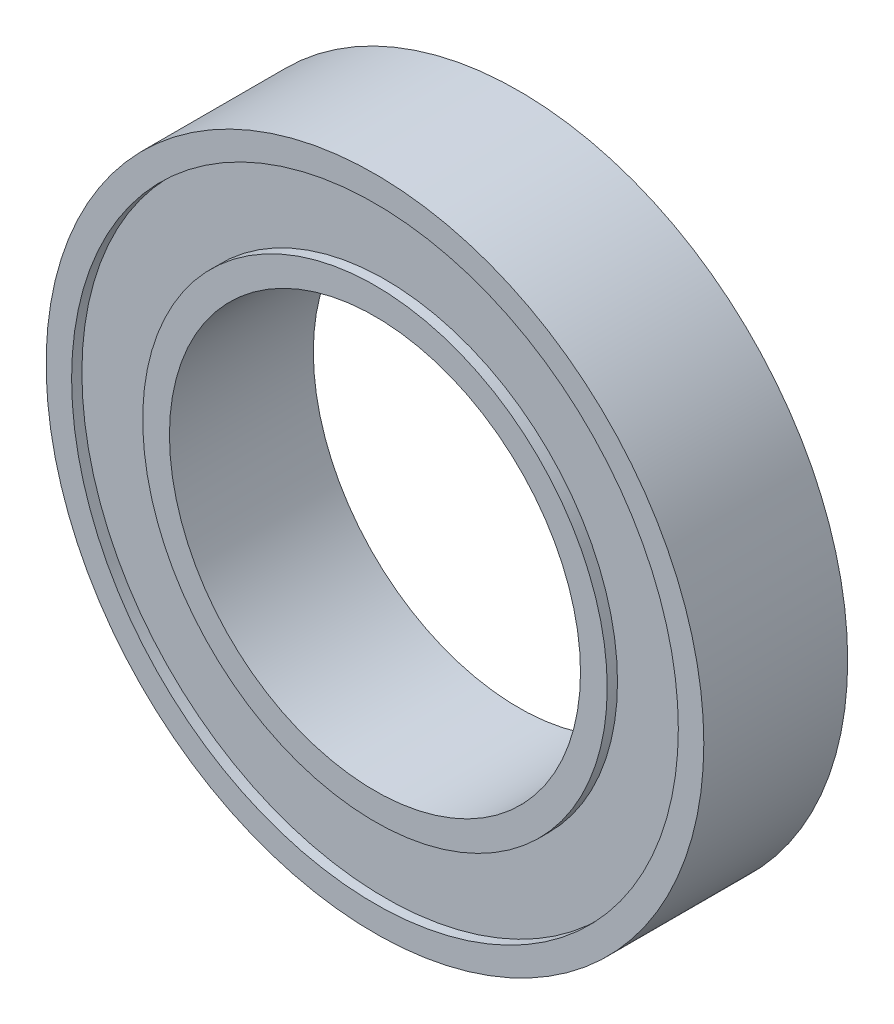
ISO-10303-21;
HEADER;
FILE_DESCRIPTION(('STEP AP214'),'2;1');
FILE_NAME('part.step','',(''),(''),'','','');
FILE_SCHEMA(('AUTOMOTIVE_DESIGN { 1 0 10303 214 1 1 1 1 }'));
ENDSEC;
DATA;
#1=APPLICATION_CONTEXT('core data for automotive mechanical design processes');
#2=APPLICATION_PROTOCOL_DEFINITION('international standard','automotive_design',2000,#1);
#3=PRODUCT_CONTEXT('',#1,'mechanical');
#4=PRODUCT('Part','Part','',(#3));
#5=PRODUCT_RELATED_PRODUCT_CATEGORY('part','',(#4));
#6=PRODUCT_DEFINITION_FORMATION('','',#4);
#7=PRODUCT_DEFINITION_CONTEXT('part definition',#1,'design');
#8=PRODUCT_DEFINITION('design','',#6,#7);
#9=PRODUCT_DEFINITION_SHAPE('','',#8);
#10=(LENGTH_UNIT() NAMED_UNIT(*) SI_UNIT(.MILLI.,.METRE.));
#11=(NAMED_UNIT(*) PLANE_ANGLE_UNIT() SI_UNIT($,.RADIAN.));
#12=(NAMED_UNIT(*) SI_UNIT($,.STERADIAN.) SOLID_ANGLE_UNIT());
#13=UNCERTAINTY_MEASURE_WITH_UNIT(LENGTH_MEASURE(1.E-05),#10,'distance_accuracy_value','');
#14=(GEOMETRIC_REPRESENTATION_CONTEXT(3) GLOBAL_UNCERTAINTY_ASSIGNED_CONTEXT((#13)) GLOBAL_UNIT_ASSIGNED_CONTEXT((#10,
#11,#12)) REPRESENTATION_CONTEXT('',''));
#15=CARTESIAN_POINT('',(0.,0.,0.));
#16=DIRECTION('',(0.,0.,1.));
#17=DIRECTION('',(1.,0.,0.));
#18=AXIS2_PLACEMENT_3D('',#15,#16,#17);
#19=CARTESIAN_POINT('',(0.,0.,0.));
#20=DIRECTION('',(0.,0.,1.));
#21=DIRECTION('',(1.,0.,0.));
#22=AXIS2_PLACEMENT_3D('',#19,#20,#21);
#23=PLANE('',#22);
#24=CARTESIAN_POINT('',(0.,0.,0.));
#25=DIRECTION('',(0.,0.,1.));
#26=DIRECTION('',(1.,0.,0.));
#27=AXIS2_PLACEMENT_3D('',#24,#25,#26);
#28=CIRCLE('',#27,10.);
#29=CARTESIAN_POINT('',(10.,0.,0.));
#30=VERTEX_POINT('',#29);
#31=EDGE_CURVE('E43',#30,#30,#28,.T.);
#32=ORIENTED_EDGE('',*,*,#31,.T.);
#33=EDGE_LOOP('',(#32));
#34=FACE_BOUND('',#33,.T.);
#35=CARTESIAN_POINT('',(0.,0.,0.));
#36=DIRECTION('',(0.,0.,-1.));
#37=DIRECTION('',(-1.,0.,0.));
#38=AXIS2_PLACEMENT_3D('',#35,#36,#37);
#39=CIRCLE('',#38,11.3);
#40=CARTESIAN_POINT('',(-11.3,0.,0.));
#41=VERTEX_POINT('',#40);
#42=EDGE_CURVE('E69',#41,#41,#39,.T.);
#43=ORIENTED_EDGE('',*,*,#42,.T.);
#44=EDGE_LOOP('',(#43));
#45=FACE_BOUND('',#44,.T.);
#46=ADVANCED_FACE('F32',(#34,#45),#23,.F.);
#47=CARTESIAN_POINT('',(0.,0.,7.));
#48=DIRECTION('',(0.,0.,1.));
#49=DIRECTION('',(1.,0.,0.));
#50=AXIS2_PLACEMENT_3D('',#47,#48,#49);
#51=PLANE('',#50);
#52=CARTESIAN_POINT('',(0.,0.,7.));
#53=DIRECTION('',(0.,0.,1.));
#54=DIRECTION('',(1.,0.,0.));
#55=AXIS2_PLACEMENT_3D('',#52,#53,#54);
#56=CIRCLE('',#55,10.);
#57=CARTESIAN_POINT('',(10.,0.,7.));
#58=VERTEX_POINT('',#57);
#59=EDGE_CURVE('E45',#58,#58,#56,.T.);
#60=ORIENTED_EDGE('',*,*,#59,.F.);
#61=EDGE_LOOP('',(#60));
#62=FACE_BOUND('',#61,.T.);
#63=CARTESIAN_POINT('',(0.,0.,7.));
#64=DIRECTION('',(0.,0.,1.));
#65=DIRECTION('',(1.,0.,0.));
#66=AXIS2_PLACEMENT_3D('',#63,#64,#65);
#67=CIRCLE('',#66,11.3);
#68=CARTESIAN_POINT('',(11.3,0.,7.));
#69=VERTEX_POINT('',#68);
#70=EDGE_CURVE('E57',#69,#69,#67,.T.);
#71=ORIENTED_EDGE('',*,*,#70,.T.);
#72=EDGE_LOOP('',(#71));
#73=FACE_BOUND('',#72,.T.);
#74=ADVANCED_FACE('F99',(#62,#73),#51,.T.);
#75=CARTESIAN_POINT('',(0.,0.,7.));
#76=DIRECTION('',(0.,0.,-1.));
#77=DIRECTION('',(-1.,0.,0.));
#78=AXIS2_PLACEMENT_3D('',#75,#76,#77);
#79=CYLINDRICAL_SURFACE('',#78,16.);
#80=CARTESIAN_POINT('',(0.,0.,7.));
#81=DIRECTION('',(0.,0.,1.));
#82=DIRECTION('',(1.,0.,0.));
#83=AXIS2_PLACEMENT_3D('',#80,#81,#82);
#84=CIRCLE('',#83,16.);
#85=CARTESIAN_POINT('',(16.,0.,7.));
#86=VERTEX_POINT('',#85);
#87=EDGE_CURVE('E10',#86,#86,#84,.T.);
#88=ORIENTED_EDGE('',*,*,#87,.F.);
#89=EDGE_LOOP('',(#88));
#90=FACE_BOUND('',#89,.T.);
#91=CARTESIAN_POINT('',(0.,0.,0.));
#92=DIRECTION('',(0.,0.,1.));
#93=DIRECTION('',(1.,0.,0.));
#94=AXIS2_PLACEMENT_3D('',#91,#92,#93);
#95=CIRCLE('',#94,16.);
#96=CARTESIAN_POINT('',(16.,0.,0.));
#97=VERTEX_POINT('',#96);
#98=EDGE_CURVE('E36',#97,#97,#95,.T.);
#99=ORIENTED_EDGE('',*,*,#98,.T.);
#100=EDGE_LOOP('',(#99));
#101=FACE_BOUND('',#100,.T.);
#102=ADVANCED_FACE('F34',(#90,#101),#79,.T.);
#103=CARTESIAN_POINT('',(0.,0.,7.));
#104=DIRECTION('',(0.,0.,1.));
#105=DIRECTION('',(1.,0.,0.));
#106=AXIS2_PLACEMENT_3D('',#103,#104,#105);
#107=CIRCLE('',#106,14.76);
#108=CARTESIAN_POINT('',(14.76,0.,7.));
#109=VERTEX_POINT('',#108);
#110=EDGE_CURVE('E51',#109,#109,#107,.T.);
#111=ORIENTED_EDGE('',*,*,#110,.F.);
#112=EDGE_LOOP('',(#111));
#113=FACE_BOUND('',#112,.T.);
#114=ORIENTED_EDGE('',*,*,#87,.T.);
#115=EDGE_LOOP('',(#114));
#116=FACE_BOUND('',#115,.T.);
#117=ADVANCED_FACE('F95',(#113,#116),#51,.T.);
#118=CARTESIAN_POINT('',(0.,0.,0.));
#119=DIRECTION('',(0.,0.,-1.));
#120=DIRECTION('',(-1.,0.,0.));
#121=AXIS2_PLACEMENT_3D('',#118,#119,#120);
#122=CIRCLE('',#121,14.76);
#123=CARTESIAN_POINT('',(-14.76,0.,0.));
#124=VERTEX_POINT('',#123);
#125=EDGE_CURVE('E63',#124,#124,#122,.T.);
#126=ORIENTED_EDGE('',*,*,#125,.F.);
#127=EDGE_LOOP('',(#126));
#128=FACE_BOUND('',#127,.T.);
#129=ORIENTED_EDGE('',*,*,#98,.F.);
#130=EDGE_LOOP('',(#129));
#131=FACE_BOUND('',#130,.T.);
#132=ADVANCED_FACE('F91',(#128,#131),#23,.F.);
#133=CARTESIAN_POINT('',(0.,0.,0.));
#134=DIRECTION('',(0.,0.,1.));
#135=DIRECTION('',(1.,0.,0.));
#136=AXIS2_PLACEMENT_3D('',#133,#134,#135);
#137=CYLINDRICAL_SURFACE('',#136,10.);
#138=ORIENTED_EDGE('',*,*,#31,.F.);
#139=EDGE_LOOP('',(#138));
#140=FACE_BOUND('',#139,.T.);
#141=ORIENTED_EDGE('',*,*,#59,.T.);
#142=EDGE_LOOP('',(#141));
#143=FACE_BOUND('',#142,.T.);
#144=ADVANCED_FACE('F94',(#140,#143),#137,.F.);
#145=CARTESIAN_POINT('',(0.,0.,6.5));
#146=DIRECTION('',(0.,0.,1.));
#147=DIRECTION('',(1.,0.,0.));
#148=AXIS2_PLACEMENT_3D('',#145,#146,#147);
#149=CYLINDRICAL_SURFACE('',#148,14.76);
#150=CARTESIAN_POINT('',(0.,0.,6.5));
#151=DIRECTION('',(0.,0.,1.));
#152=DIRECTION('',(1.,0.,0.));
#153=AXIS2_PLACEMENT_3D('',#150,#151,#152);
#154=CIRCLE('',#153,14.76);
#155=CARTESIAN_POINT('',(14.76,0.,6.5));
#156=VERTEX_POINT('',#155);
#157=EDGE_CURVE('E48',#156,#156,#154,.T.);
#158=ORIENTED_EDGE('',*,*,#157,.F.);
#159=EDGE_LOOP('',(#158));
#160=FACE_BOUND('',#159,.T.);
#161=ORIENTED_EDGE('',*,*,#110,.T.);
#162=EDGE_LOOP('',(#161));
#163=FACE_BOUND('',#162,.T.);
#164=ADVANCED_FACE('F116',(#160,#163),#149,.F.);
#165=CARTESIAN_POINT('',(0.,0.,6.5));
#166=DIRECTION('',(0.,0.,1.));
#167=DIRECTION('',(1.,0.,0.));
#168=AXIS2_PLACEMENT_3D('',#165,#166,#167);
#169=PLANE('',#168);
#170=CARTESIAN_POINT('',(0.,0.,6.5));
#171=DIRECTION('',(0.,0.,1.));
#172=DIRECTION('',(1.,0.,0.));
#173=AXIS2_PLACEMENT_3D('',#170,#171,#172);
#174=CIRCLE('',#173,11.3);
#175=CARTESIAN_POINT('',(11.3,0.,6.5));
#176=VERTEX_POINT('',#175);
#177=EDGE_CURVE('E54',#176,#176,#174,.T.);
#178=ORIENTED_EDGE('',*,*,#177,.F.);
#179=EDGE_LOOP('',(#178));
#180=FACE_BOUND('',#179,.T.);
#181=ORIENTED_EDGE('',*,*,#157,.T.);
#182=EDGE_LOOP('',(#181));
#183=FACE_BOUND('',#182,.T.);
#184=ADVANCED_FACE('F120',(#180,#183),#169,.T.);
#185=CARTESIAN_POINT('',(0.,0.,6.5));
#186=DIRECTION('',(0.,0.,1.));
#187=DIRECTION('',(1.,0.,0.));
#188=AXIS2_PLACEMENT_3D('',#185,#186,#187);
#189=CYLINDRICAL_SURFACE('',#188,11.3);
#190=ORIENTED_EDGE('',*,*,#177,.T.);
#191=EDGE_LOOP('',(#190));
#192=FACE_BOUND('',#191,.T.);
#193=ORIENTED_EDGE('',*,*,#70,.F.);
#194=EDGE_LOOP('',(#193));
#195=FACE_BOUND('',#194,.T.);
#196=ADVANCED_FACE('F87',(#192,#195),#189,.T.);
#197=CARTESIAN_POINT('',(0.,0.,0.5));
#198=DIRECTION('',(0.,0.,-1.));
#199=DIRECTION('',(-1.,0.,0.));
#200=AXIS2_PLACEMENT_3D('',#197,#198,#199);
#201=CYLINDRICAL_SURFACE('',#200,14.76);
#202=CARTESIAN_POINT('',(0.,0.,0.5));
#203=DIRECTION('',(0.,0.,-1.));
#204=DIRECTION('',(-1.,0.,0.));
#205=AXIS2_PLACEMENT_3D('',#202,#203,#204);
#206=CIRCLE('',#205,14.76);
#207=CARTESIAN_POINT('',(-14.76,0.,0.5));
#208=VERTEX_POINT('',#207);
#209=EDGE_CURVE('E60',#208,#208,#206,.T.);
#210=ORIENTED_EDGE('',*,*,#209,.F.);
#211=EDGE_LOOP('',(#210));
#212=FACE_BOUND('',#211,.T.);
#213=ORIENTED_EDGE('',*,*,#125,.T.);
#214=EDGE_LOOP('',(#213));
#215=FACE_BOUND('',#214,.T.);
#216=ADVANCED_FACE('F81',(#212,#215),#201,.F.);
#217=CARTESIAN_POINT('',(0.,0.,0.5));
#218=DIRECTION('',(0.,0.,-1.));
#219=DIRECTION('',(-1.,0.,0.));
#220=AXIS2_PLACEMENT_3D('',#217,#218,#219);
#221=PLANE('',#220);
#222=CARTESIAN_POINT('',(0.,0.,0.5));
#223=DIRECTION('',(0.,0.,-1.));
#224=DIRECTION('',(-1.,0.,0.));
#225=AXIS2_PLACEMENT_3D('',#222,#223,#224);
#226=CIRCLE('',#225,11.3);
#227=CARTESIAN_POINT('',(-11.3,0.,0.5));
#228=VERTEX_POINT('',#227);
#229=EDGE_CURVE('E66',#228,#228,#226,.T.);
#230=ORIENTED_EDGE('',*,*,#229,.F.);
#231=EDGE_LOOP('',(#230));
#232=FACE_BOUND('',#231,.T.);
#233=ORIENTED_EDGE('',*,*,#209,.T.);
#234=EDGE_LOOP('',(#233));
#235=FACE_BOUND('',#234,.T.);
#236=ADVANCED_FACE('F78',(#232,#235),#221,.T.);
#237=CARTESIAN_POINT('',(0.,0.,0.5));
#238=DIRECTION('',(0.,0.,-1.));
#239=DIRECTION('',(-1.,0.,0.));
#240=AXIS2_PLACEMENT_3D('',#237,#238,#239);
#241=CYLINDRICAL_SURFACE('',#240,11.3);
#242=ORIENTED_EDGE('',*,*,#229,.T.);
#243=EDGE_LOOP('',(#242));
#244=FACE_BOUND('',#243,.T.);
#245=ORIENTED_EDGE('',*,*,#42,.F.);
#246=EDGE_LOOP('',(#245));
#247=FACE_BOUND('',#246,.T.);
#248=ADVANCED_FACE('F75',(#244,#247),#241,.T.);
#249=CLOSED_SHELL('',(#46,#74,#102,#117,#132,#144,#164,#184,#196,#216,#236,#248));
#250=MANIFOLD_SOLID_BREP('B2',#249);
#251=ADVANCED_BREP_SHAPE_REPRESENTATION('',(#18,#250),#14);
#252=SHAPE_DEFINITION_REPRESENTATION(#9,#251);
ENDSEC;
END-ISO-10303-21;
